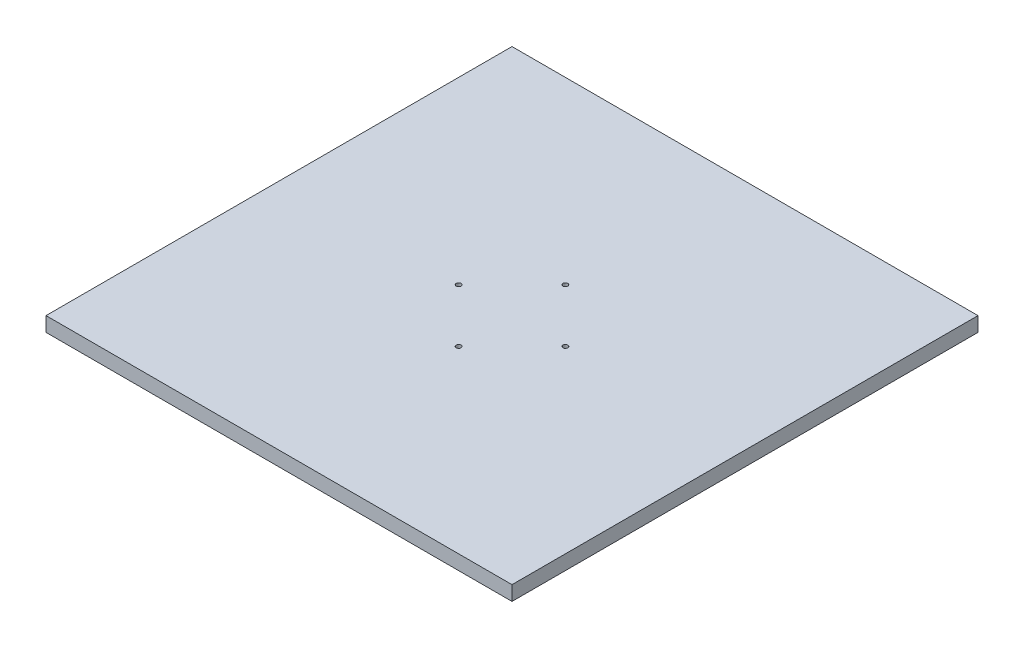
ISO-10303-21;
HEADER;
FILE_DESCRIPTION(('STEP AP214'),'2;1');
FILE_NAME('part.step','',(''),(''),'','','');
FILE_SCHEMA(('AUTOMOTIVE_DESIGN { 1 0 10303 214 1 1 1 1 }'));
ENDSEC;
DATA;
#1=APPLICATION_CONTEXT('core data for automotive mechanical design processes');
#2=APPLICATION_PROTOCOL_DEFINITION('international standard','automotive_design',2000,#1);
#3=PRODUCT_CONTEXT('',#1,'mechanical');
#4=PRODUCT('Part','Part','',(#3));
#5=PRODUCT_RELATED_PRODUCT_CATEGORY('part','',(#4));
#6=PRODUCT_DEFINITION_FORMATION('','',#4);
#7=PRODUCT_DEFINITION_CONTEXT('part definition',#1,'design');
#8=PRODUCT_DEFINITION('design','',#6,#7);
#9=PRODUCT_DEFINITION_SHAPE('','',#8);
#10=(LENGTH_UNIT() NAMED_UNIT(*) SI_UNIT(.MILLI.,.METRE.));
#11=(NAMED_UNIT(*) PLANE_ANGLE_UNIT() SI_UNIT($,.RADIAN.));
#12=(NAMED_UNIT(*) SI_UNIT($,.STERADIAN.) SOLID_ANGLE_UNIT());
#13=UNCERTAINTY_MEASURE_WITH_UNIT(LENGTH_MEASURE(1.E-05),#10,'distance_accuracy_value','');
#14=(GEOMETRIC_REPRESENTATION_CONTEXT(3) GLOBAL_UNCERTAINTY_ASSIGNED_CONTEXT((#13)) GLOBAL_UNIT_ASSIGNED_CONTEXT((#10,
#11,#12)) REPRESENTATION_CONTEXT('',''));
#15=CARTESIAN_POINT('',(0.,0.,0.));
#16=DIRECTION('',(0.,0.,1.));
#17=DIRECTION('',(1.,0.,0.));
#18=AXIS2_PLACEMENT_3D('',#15,#16,#17);
#19=CARTESIAN_POINT('',(0.,19.05,0.));
#20=DIRECTION('',(1.,0.,0.));
#21=DIRECTION('',(0.,0.,-1.));
#22=AXIS2_PLACEMENT_3D('',#19,#20,#21);
#23=PLANE('',#22);
#24=DIRECTION('',(0.,0.,1.));
#25=VECTOR('',#24,1.);
#26=CARTESIAN_POINT('',(0.,0.,0.));
#27=LINE('',#26,#25);
#28=CARTESIAN_POINT('',(0.,0.,-609.6));
#29=VERTEX_POINT('',#28);
#30=CARTESIAN_POINT('',(0.,0.,0.));
#31=VERTEX_POINT('',#30);
#32=EDGE_CURVE('E101',#29,#31,#27,.T.);
#33=ORIENTED_EDGE('',*,*,#32,.T.);
#34=DIRECTION('',(0.,-1.,0.));
#35=VECTOR('',#34,1.);
#36=CARTESIAN_POINT('',(0.,19.05,0.));
#37=LINE('',#36,#35);
#38=CARTESIAN_POINT('',(0.,19.05,0.));
#39=VERTEX_POINT('',#38);
#40=EDGE_CURVE('E11',#39,#31,#37,.T.);
#41=ORIENTED_EDGE('',*,*,#40,.F.);
#42=DIRECTION('',(0.,0.,1.));
#43=VECTOR('',#42,1.);
#44=CARTESIAN_POINT('',(0.,19.05,0.));
#45=LINE('',#44,#43);
#46=CARTESIAN_POINT('',(0.,19.05,-609.6));
#47=VERTEX_POINT('',#46);
#48=EDGE_CURVE('E89',#47,#39,#45,.T.);
#49=ORIENTED_EDGE('',*,*,#48,.F.);
#50=DIRECTION('',(0.,-1.,0.));
#51=VECTOR('',#50,1.);
#52=CARTESIAN_POINT('',(0.,19.05,-609.6));
#53=LINE('',#52,#51);
#54=EDGE_CURVE('E97',#47,#29,#53,.T.);
#55=ORIENTED_EDGE('',*,*,#54,.T.);
#56=EDGE_LOOP('',(#33,#41,#49,#55));
#57=FACE_BOUND('',#56,.T.);
#58=ADVANCED_FACE('F38',(#57),#23,.F.);
#59=CARTESIAN_POINT('',(0.,19.05,0.));
#60=DIRECTION('',(0.,0.,-1.));
#61=DIRECTION('',(-1.,0.,0.));
#62=AXIS2_PLACEMENT_3D('',#59,#60,#61);
#63=PLANE('',#62);
#64=DIRECTION('',(1.,0.,0.));
#65=VECTOR('',#64,1.);
#66=CARTESIAN_POINT('',(0.,0.,0.));
#67=LINE('',#66,#65);
#68=CARTESIAN_POINT('',(609.6,0.,0.));
#69=VERTEX_POINT('',#68);
#70=EDGE_CURVE('E93',#31,#69,#67,.T.);
#71=ORIENTED_EDGE('',*,*,#70,.T.);
#72=DIRECTION('',(0.,-1.,0.));
#73=VECTOR('',#72,1.);
#74=CARTESIAN_POINT('',(609.6,19.05,0.));
#75=LINE('',#74,#73);
#76=CARTESIAN_POINT('',(609.6,19.05,0.));
#77=VERTEX_POINT('',#76);
#78=EDGE_CURVE('E46',#77,#69,#75,.T.);
#79=ORIENTED_EDGE('',*,*,#78,.F.);
#80=DIRECTION('',(1.,0.,0.));
#81=VECTOR('',#80,1.);
#82=CARTESIAN_POINT('',(0.,19.05,0.));
#83=LINE('',#82,#81);
#84=EDGE_CURVE('E84',#39,#77,#83,.T.);
#85=ORIENTED_EDGE('',*,*,#84,.F.);
#86=ORIENTED_EDGE('',*,*,#40,.T.);
#87=EDGE_LOOP('',(#71,#79,#85,#86));
#88=FACE_BOUND('',#87,.T.);
#89=ADVANCED_FACE('F92',(#88),#63,.F.);
#90=CARTESIAN_POINT('',(609.6,19.05,0.));
#91=DIRECTION('',(-1.,0.,0.));
#92=DIRECTION('',(0.,0.,1.));
#93=AXIS2_PLACEMENT_3D('',#90,#91,#92);
#94=PLANE('',#93);
#95=DIRECTION('',(0.,0.,-1.));
#96=VECTOR('',#95,1.);
#97=CARTESIAN_POINT('',(609.6,0.,0.));
#98=LINE('',#97,#96);
#99=CARTESIAN_POINT('',(609.6,0.,-609.6));
#100=VERTEX_POINT('',#99);
#101=EDGE_CURVE('E71',#69,#100,#98,.T.);
#102=ORIENTED_EDGE('',*,*,#101,.T.);
#103=DIRECTION('',(0.,-1.,0.));
#104=VECTOR('',#103,1.);
#105=CARTESIAN_POINT('',(609.6,19.05,-609.6));
#106=LINE('',#105,#104);
#107=CARTESIAN_POINT('',(609.6,19.05,-609.6));
#108=VERTEX_POINT('',#107);
#109=EDGE_CURVE('E94',#108,#100,#106,.T.);
#110=ORIENTED_EDGE('',*,*,#109,.F.);
#111=DIRECTION('',(0.,0.,-1.));
#112=VECTOR('',#111,1.);
#113=CARTESIAN_POINT('',(609.6,19.05,0.));
#114=LINE('',#113,#112);
#115=EDGE_CURVE('E87',#77,#108,#114,.T.);
#116=ORIENTED_EDGE('',*,*,#115,.F.);
#117=ORIENTED_EDGE('',*,*,#78,.T.);
#118=EDGE_LOOP('',(#102,#110,#116,#117));
#119=FACE_BOUND('',#118,.T.);
#120=ADVANCED_FACE('F95',(#119),#94,.F.);
#121=CARTESIAN_POINT('',(0.,19.05,-609.6));
#122=DIRECTION('',(0.,0.,1.));
#123=DIRECTION('',(1.,0.,0.));
#124=AXIS2_PLACEMENT_3D('',#121,#122,#123);
#125=PLANE('',#124);
#126=DIRECTION('',(-1.,0.,0.));
#127=VECTOR('',#126,1.);
#128=CARTESIAN_POINT('',(0.,0.,-609.6));
#129=LINE('',#128,#127);
#130=EDGE_CURVE('E77',#100,#29,#129,.T.);
#131=ORIENTED_EDGE('',*,*,#130,.T.);
#132=ORIENTED_EDGE('',*,*,#54,.F.);
#133=DIRECTION('',(-1.,0.,0.));
#134=VECTOR('',#133,1.);
#135=CARTESIAN_POINT('',(0.,19.05,-609.6));
#136=LINE('',#135,#134);
#137=EDGE_CURVE('E54',#108,#47,#136,.T.);
#138=ORIENTED_EDGE('',*,*,#137,.F.);
#139=ORIENTED_EDGE('',*,*,#109,.T.);
#140=EDGE_LOOP('',(#131,#132,#138,#139));
#141=FACE_BOUND('',#140,.T.);
#142=ADVANCED_FACE('F109',(#141),#125,.F.);
#143=CARTESIAN_POINT('',(0.,19.05,0.));
#144=DIRECTION('',(0.,-1.,0.));
#145=DIRECTION('',(0.,0.,-1.));
#146=AXIS2_PLACEMENT_3D('',#143,#144,#145);
#147=PLANE('',#146);
#148=CARTESIAN_POINT('',(304.8,19.05,-374.65));
#149=DIRECTION('',(0.,1.,0.));
#150=DIRECTION('',(0.,0.,1.));
#151=AXIS2_PLACEMENT_3D('',#148,#149,#150);
#152=CIRCLE('',#151,3.17499999999997);
#153=CARTESIAN_POINT('',(304.8,19.05,-371.475));
#154=VERTEX_POINT('',#153);
#155=EDGE_CURVE('E104',#154,#154,#152,.T.);
#156=ORIENTED_EDGE('',*,*,#155,.F.);
#157=EDGE_LOOP('',(#156));
#158=FACE_BOUND('',#157,.T.);
#159=CARTESIAN_POINT('',(234.95,19.05,-304.8));
#160=DIRECTION('',(0.,1.,0.));
#161=DIRECTION('',(0.,0.,1.));
#162=AXIS2_PLACEMENT_3D('',#159,#160,#161);
#163=CIRCLE('',#162,3.175);
#164=CARTESIAN_POINT('',(234.95,19.05,-301.625));
#165=VERTEX_POINT('',#164);
#166=EDGE_CURVE('E122',#165,#165,#163,.T.);
#167=ORIENTED_EDGE('',*,*,#166,.F.);
#168=EDGE_LOOP('',(#167));
#169=FACE_BOUND('',#168,.T.);
#170=CARTESIAN_POINT('',(374.65,19.05,-304.8));
#171=DIRECTION('',(0.,1.,0.));
#172=DIRECTION('',(0.,0.,1.));
#173=AXIS2_PLACEMENT_3D('',#170,#171,#172);
#174=CIRCLE('',#173,3.17499999999997);
#175=CARTESIAN_POINT('',(374.65,19.05,-301.625));
#176=VERTEX_POINT('',#175);
#177=EDGE_CURVE('E118',#176,#176,#174,.T.);
#178=ORIENTED_EDGE('',*,*,#177,.F.);
#179=EDGE_LOOP('',(#178));
#180=FACE_BOUND('',#179,.T.);
#181=CARTESIAN_POINT('',(304.8,19.05,-234.95));
#182=DIRECTION('',(0.,1.,0.));
#183=DIRECTION('',(0.,0.,1.));
#184=AXIS2_PLACEMENT_3D('',#181,#182,#183);
#185=CIRCLE('',#184,3.17499999999997);
#186=CARTESIAN_POINT('',(304.8,19.05,-231.775));
#187=VERTEX_POINT('',#186);
#188=EDGE_CURVE('E115',#187,#187,#185,.T.);
#189=ORIENTED_EDGE('',*,*,#188,.F.);
#190=EDGE_LOOP('',(#189));
#191=FACE_BOUND('',#190,.T.);
#192=ORIENTED_EDGE('',*,*,#48,.T.);
#193=ORIENTED_EDGE('',*,*,#84,.T.);
#194=ORIENTED_EDGE('',*,*,#115,.T.);
#195=ORIENTED_EDGE('',*,*,#137,.T.);
#196=EDGE_LOOP('',(#192,#193,#194,#195));
#197=FACE_BOUND('',#196,.T.);
#198=ADVANCED_FACE('F85',(#158,#169,#180,#191,#197),#147,.F.);
#199=CARTESIAN_POINT('',(0.,0.,0.));
#200=DIRECTION('',(0.,-1.,0.));
#201=DIRECTION('',(0.,0.,-1.));
#202=AXIS2_PLACEMENT_3D('',#199,#200,#201);
#203=PLANE('',#202);
#204=CARTESIAN_POINT('',(234.95,0.,-304.8));
#205=DIRECTION('',(0.,-1.,0.));
#206=DIRECTION('',(0.,0.,-1.));
#207=AXIS2_PLACEMENT_3D('',#204,#205,#206);
#208=CIRCLE('',#207,9.52500000000001);
#209=CARTESIAN_POINT('',(234.95,0.,-314.325));
#210=VERTEX_POINT('',#209);
#211=EDGE_CURVE('E165',#210,#210,#208,.T.);
#212=ORIENTED_EDGE('',*,*,#211,.F.);
#213=EDGE_LOOP('',(#212));
#214=FACE_BOUND('',#213,.T.);
#215=CARTESIAN_POINT('',(304.8,0.,-234.95));
#216=DIRECTION('',(0.,-1.,0.));
#217=DIRECTION('',(0.,0.,-1.));
#218=AXIS2_PLACEMENT_3D('',#215,#216,#217);
#219=CIRCLE('',#218,9.52500000000001);
#220=CARTESIAN_POINT('',(304.8,0.,-244.475));
#221=VERTEX_POINT('',#220);
#222=EDGE_CURVE('E156',#221,#221,#219,.T.);
#223=ORIENTED_EDGE('',*,*,#222,.F.);
#224=EDGE_LOOP('',(#223));
#225=FACE_BOUND('',#224,.T.);
#226=CARTESIAN_POINT('',(374.65,0.,-304.8));
#227=DIRECTION('',(0.,-1.,0.));
#228=DIRECTION('',(0.,0.,-1.));
#229=AXIS2_PLACEMENT_3D('',#226,#227,#228);
#230=CIRCLE('',#229,9.52500000000001);
#231=CARTESIAN_POINT('',(374.65,0.,-314.325));
#232=VERTEX_POINT('',#231);
#233=EDGE_CURVE('E147',#232,#232,#230,.T.);
#234=ORIENTED_EDGE('',*,*,#233,.F.);
#235=EDGE_LOOP('',(#234));
#236=FACE_BOUND('',#235,.T.);
#237=CARTESIAN_POINT('',(304.8,0.,-374.65));
#238=DIRECTION('',(0.,-1.,0.));
#239=DIRECTION('',(0.,0.,-1.));
#240=AXIS2_PLACEMENT_3D('',#237,#238,#239);
#241=CIRCLE('',#240,9.52500000000001);
#242=CARTESIAN_POINT('',(304.8,0.,-384.175));
#243=VERTEX_POINT('',#242);
#244=EDGE_CURVE('E138',#243,#243,#241,.T.);
#245=ORIENTED_EDGE('',*,*,#244,.F.);
#246=EDGE_LOOP('',(#245));
#247=FACE_BOUND('',#246,.T.);
#248=CARTESIAN_POINT('',(304.8,0.,-304.8));
#249=DIRECTION('',(0.,1.,0.));
#250=DIRECTION('',(0.,0.,1.));
#251=AXIS2_PLACEMENT_3D('',#248,#249,#250);
#252=CIRCLE('',#251,8.76583361188347);
#253=CARTESIAN_POINT('',(304.8,0.,-296.034166388117));
#254=VERTEX_POINT('',#253);
#255=EDGE_CURVE('E127',#254,#254,#252,.T.);
#256=ORIENTED_EDGE('',*,*,#255,.T.);
#257=EDGE_LOOP('',(#256));
#258=FACE_BOUND('',#257,.T.);
#259=ORIENTED_EDGE('',*,*,#32,.F.);
#260=ORIENTED_EDGE('',*,*,#130,.F.);
#261=ORIENTED_EDGE('',*,*,#101,.F.);
#262=ORIENTED_EDGE('',*,*,#70,.F.);
#263=EDGE_LOOP('',(#259,#260,#261,#262));
#264=FACE_BOUND('',#263,.T.);
#265=ADVANCED_FACE('F112',(#214,#225,#236,#247,#258,#264),#203,.T.);
#266=CARTESIAN_POINT('',(304.8,0.,-234.95));
#267=DIRECTION('',(0.,1.,0.));
#268=DIRECTION('',(0.,0.,1.));
#269=AXIS2_PLACEMENT_3D('',#266,#267,#268);
#270=CYLINDRICAL_SURFACE('',#269,3.17499999999997);
#271=CARTESIAN_POINT('',(304.8,6.35,-234.95));
#272=DIRECTION('',(0.,-1.,0.));
#273=DIRECTION('',(0.,0.,-1.));
#274=AXIS2_PLACEMENT_3D('',#271,#272,#273);
#275=CIRCLE('',#274,3.17500000000004);
#276=CARTESIAN_POINT('',(304.8,6.35,-238.125));
#277=VERTEX_POINT('',#276);
#278=EDGE_CURVE('E150',#277,#277,#275,.T.);
#279=ORIENTED_EDGE('',*,*,#278,.T.);
#280=EDGE_LOOP('',(#279));
#281=FACE_BOUND('',#280,.T.);
#282=ORIENTED_EDGE('',*,*,#188,.T.);
#283=EDGE_LOOP('',(#282));
#284=FACE_BOUND('',#283,.T.);
#285=ADVANCED_FACE('F173',(#281,#284),#270,.F.);
#286=CARTESIAN_POINT('',(374.65,0.,-304.8));
#287=DIRECTION('',(0.,1.,0.));
#288=DIRECTION('',(0.,0.,1.));
#289=AXIS2_PLACEMENT_3D('',#286,#287,#288);
#290=CYLINDRICAL_SURFACE('',#289,3.17499999999997);
#291=CARTESIAN_POINT('',(374.65,6.35,-304.8));
#292=DIRECTION('',(0.,-1.,0.));
#293=DIRECTION('',(0.,0.,-1.));
#294=AXIS2_PLACEMENT_3D('',#291,#292,#293);
#295=CIRCLE('',#294,3.17500000000004);
#296=CARTESIAN_POINT('',(374.65,6.35,-307.975));
#297=VERTEX_POINT('',#296);
#298=EDGE_CURVE('E141',#297,#297,#295,.T.);
#299=ORIENTED_EDGE('',*,*,#298,.T.);
#300=EDGE_LOOP('',(#299));
#301=FACE_BOUND('',#300,.T.);
#302=ORIENTED_EDGE('',*,*,#177,.T.);
#303=EDGE_LOOP('',(#302));
#304=FACE_BOUND('',#303,.T.);
#305=ADVANCED_FACE('F215',(#301,#304),#290,.F.);
#306=CARTESIAN_POINT('',(234.95,0.,-304.8));
#307=DIRECTION('',(0.,1.,0.));
#308=DIRECTION('',(0.,0.,1.));
#309=AXIS2_PLACEMENT_3D('',#306,#307,#308);
#310=CYLINDRICAL_SURFACE('',#309,3.175);
#311=CARTESIAN_POINT('',(234.95,6.35,-304.8));
#312=DIRECTION('',(0.,-1.,0.));
#313=DIRECTION('',(0.,0.,-1.));
#314=AXIS2_PLACEMENT_3D('',#311,#312,#313);
#315=CIRCLE('',#314,3.17500000000001);
#316=CARTESIAN_POINT('',(234.95,6.35,-307.975));
#317=VERTEX_POINT('',#316);
#318=EDGE_CURVE('E159',#317,#317,#315,.T.);
#319=ORIENTED_EDGE('',*,*,#318,.T.);
#320=EDGE_LOOP('',(#319));
#321=FACE_BOUND('',#320,.T.);
#322=ORIENTED_EDGE('',*,*,#166,.T.);
#323=EDGE_LOOP('',(#322));
#324=FACE_BOUND('',#323,.T.);
#325=ADVANCED_FACE('F196',(#321,#324),#310,.F.);
#326=CARTESIAN_POINT('',(304.8,0.,-374.65));
#327=DIRECTION('',(0.,1.,0.));
#328=DIRECTION('',(0.,0.,1.));
#329=AXIS2_PLACEMENT_3D('',#326,#327,#328);
#330=CYLINDRICAL_SURFACE('',#329,3.17499999999997);
#331=CARTESIAN_POINT('',(304.8,6.35,-374.65));
#332=DIRECTION('',(0.,-1.,0.));
#333=DIRECTION('',(0.,0.,-1.));
#334=AXIS2_PLACEMENT_3D('',#331,#332,#333);
#335=CIRCLE('',#334,3.17500000000004);
#336=CARTESIAN_POINT('',(304.8,6.35,-377.825));
#337=VERTEX_POINT('',#336);
#338=EDGE_CURVE('E130',#337,#337,#335,.T.);
#339=ORIENTED_EDGE('',*,*,#338,.T.);
#340=EDGE_LOOP('',(#339));
#341=FACE_BOUND('',#340,.T.);
#342=ORIENTED_EDGE('',*,*,#155,.T.);
#343=EDGE_LOOP('',(#342));
#344=FACE_BOUND('',#343,.T.);
#345=ADVANCED_FACE('F186',(#341,#344),#330,.F.);
#346=CARTESIAN_POINT('',(304.8,2.54,-304.8));
#347=DIRECTION('',(0.,-1.,0.));
#348=DIRECTION('',(0.,0.,-1.));
#349=AXIS2_PLACEMENT_3D('',#346,#347,#348);
#350=CYLINDRICAL_SURFACE('',#349,8.76583361188347);
#351=CARTESIAN_POINT('',(304.8,2.54,-304.8));
#352=DIRECTION('',(0.,1.,0.));
#353=DIRECTION('',(0.,0.,1.));
#354=AXIS2_PLACEMENT_3D('',#351,#352,#353);
#355=CIRCLE('',#354,8.76583361188347);
#356=CARTESIAN_POINT('',(304.8,2.54,-296.034166388117));
#357=VERTEX_POINT('',#356);
#358=EDGE_CURVE('E119',#357,#357,#355,.T.);
#359=ORIENTED_EDGE('',*,*,#358,.T.);
#360=EDGE_LOOP('',(#359));
#361=FACE_BOUND('',#360,.T.);
#362=ORIENTED_EDGE('',*,*,#255,.F.);
#363=EDGE_LOOP('',(#362));
#364=FACE_BOUND('',#363,.T.);
#365=ADVANCED_FACE('F183',(#361,#364),#350,.F.);
#366=CARTESIAN_POINT('',(304.8,2.54,-304.8));
#367=DIRECTION('',(0.,1.,0.));
#368=DIRECTION('',(0.,0.,1.));
#369=AXIS2_PLACEMENT_3D('',#366,#367,#368);
#370=PLANE('',#369);
#371=ORIENTED_EDGE('',*,*,#358,.F.);
#372=EDGE_LOOP('',(#371));
#373=FACE_BOUND('',#372,.T.);
#374=ADVANCED_FACE('F185',(#373),#370,.F.);
#375=CARTESIAN_POINT('',(307.975,6.35,-374.65));
#376=DIRECTION('',(0.,1.,0.));
#377=DIRECTION('',(0.,0.,1.));
#378=AXIS2_PLACEMENT_3D('',#375,#376,#377);
#379=PLANE('',#378);
#380=ORIENTED_EDGE('',*,*,#338,.F.);
#381=EDGE_LOOP('',(#380));
#382=FACE_BOUND('',#381,.T.);
#383=CARTESIAN_POINT('',(304.8,6.35,-374.65));
#384=DIRECTION('',(0.,-1.,0.));
#385=DIRECTION('',(0.,0.,-1.));
#386=AXIS2_PLACEMENT_3D('',#383,#384,#385);
#387=CIRCLE('',#386,9.52500000000001);
#388=CARTESIAN_POINT('',(304.8,6.35,-384.175));
#389=VERTEX_POINT('',#388);
#390=EDGE_CURVE('E135',#389,#389,#387,.T.);
#391=ORIENTED_EDGE('',*,*,#390,.T.);
#392=EDGE_LOOP('',(#391));
#393=FACE_BOUND('',#392,.T.);
#394=ADVANCED_FACE('F193',(#382,#393),#379,.F.);
#395=CARTESIAN_POINT('',(304.8,0.,-374.65));
#396=DIRECTION('',(0.,-1.,0.));
#397=DIRECTION('',(0.,0.,-1.));
#398=AXIS2_PLACEMENT_3D('',#395,#396,#397);
#399=CYLINDRICAL_SURFACE('',#398,9.52500000000001);
#400=ORIENTED_EDGE('',*,*,#390,.F.);
#401=EDGE_LOOP('',(#400));
#402=FACE_BOUND('',#401,.T.);
#403=ORIENTED_EDGE('',*,*,#244,.T.);
#404=EDGE_LOOP('',(#403));
#405=FACE_BOUND('',#404,.T.);
#406=ADVANCED_FACE('F261',(#402,#405),#399,.F.);
#407=CARTESIAN_POINT('',(377.825,6.35,-304.8));
#408=DIRECTION('',(0.,1.,0.));
#409=DIRECTION('',(0.,0.,1.));
#410=AXIS2_PLACEMENT_3D('',#407,#408,#409);
#411=PLANE('',#410);
#412=ORIENTED_EDGE('',*,*,#298,.F.);
#413=EDGE_LOOP('',(#412));
#414=FACE_BOUND('',#413,.T.);
#415=CARTESIAN_POINT('',(374.65,6.35,-304.8));
#416=DIRECTION('',(0.,-1.,0.));
#417=DIRECTION('',(0.,0.,-1.));
#418=AXIS2_PLACEMENT_3D('',#415,#416,#417);
#419=CIRCLE('',#418,9.52500000000001);
#420=CARTESIAN_POINT('',(374.65,6.35,-314.325));
#421=VERTEX_POINT('',#420);
#422=EDGE_CURVE('E144',#421,#421,#419,.T.);
#423=ORIENTED_EDGE('',*,*,#422,.T.);
#424=EDGE_LOOP('',(#423));
#425=FACE_BOUND('',#424,.T.);
#426=ADVANCED_FACE('F257',(#414,#425),#411,.F.);
#427=CARTESIAN_POINT('',(374.65,0.,-304.8));
#428=DIRECTION('',(0.,-1.,0.));
#429=DIRECTION('',(0.,0.,-1.));
#430=AXIS2_PLACEMENT_3D('',#427,#428,#429);
#431=CYLINDRICAL_SURFACE('',#430,9.52500000000001);
#432=ORIENTED_EDGE('',*,*,#422,.F.);
#433=EDGE_LOOP('',(#432));
#434=FACE_BOUND('',#433,.T.);
#435=ORIENTED_EDGE('',*,*,#233,.T.);
#436=EDGE_LOOP('',(#435));
#437=FACE_BOUND('',#436,.T.);
#438=ADVANCED_FACE('F253',(#434,#437),#431,.F.);
#439=CARTESIAN_POINT('',(307.975,6.35,-234.95));
#440=DIRECTION('',(0.,1.,0.));
#441=DIRECTION('',(0.,0.,1.));
#442=AXIS2_PLACEMENT_3D('',#439,#440,#441);
#443=PLANE('',#442);
#444=ORIENTED_EDGE('',*,*,#278,.F.);
#445=EDGE_LOOP('',(#444));
#446=FACE_BOUND('',#445,.T.);
#447=CARTESIAN_POINT('',(304.8,6.35,-234.95));
#448=DIRECTION('',(0.,-1.,0.));
#449=DIRECTION('',(0.,0.,-1.));
#450=AXIS2_PLACEMENT_3D('',#447,#448,#449);
#451=CIRCLE('',#450,9.52500000000001);
#452=CARTESIAN_POINT('',(304.8,6.35,-244.475));
#453=VERTEX_POINT('',#452);
#454=EDGE_CURVE('E153',#453,#453,#451,.T.);
#455=ORIENTED_EDGE('',*,*,#454,.T.);
#456=EDGE_LOOP('',(#455));
#457=FACE_BOUND('',#456,.T.);
#458=ADVANCED_FACE('F249',(#446,#457),#443,.F.);
#459=CARTESIAN_POINT('',(304.8,0.,-234.95));
#460=DIRECTION('',(0.,-1.,0.));
#461=DIRECTION('',(0.,0.,-1.));
#462=AXIS2_PLACEMENT_3D('',#459,#460,#461);
#463=CYLINDRICAL_SURFACE('',#462,9.52500000000001);
#464=ORIENTED_EDGE('',*,*,#454,.F.);
#465=EDGE_LOOP('',(#464));
#466=FACE_BOUND('',#465,.T.);
#467=ORIENTED_EDGE('',*,*,#222,.T.);
#468=EDGE_LOOP('',(#467));
#469=FACE_BOUND('',#468,.T.);
#470=ADVANCED_FACE('F238',(#466,#469),#463,.F.);
#471=CARTESIAN_POINT('',(238.125,6.35,-304.8));
#472=DIRECTION('',(0.,1.,0.));
#473=DIRECTION('',(0.,0.,1.));
#474=AXIS2_PLACEMENT_3D('',#471,#472,#473);
#475=PLANE('',#474);
#476=ORIENTED_EDGE('',*,*,#318,.F.);
#477=EDGE_LOOP('',(#476));
#478=FACE_BOUND('',#477,.T.);
#479=CARTESIAN_POINT('',(234.95,6.35,-304.8));
#480=DIRECTION('',(0.,-1.,0.));
#481=DIRECTION('',(0.,0.,-1.));
#482=AXIS2_PLACEMENT_3D('',#479,#480,#481);
#483=CIRCLE('',#482,9.52500000000001);
#484=CARTESIAN_POINT('',(234.95,6.35,-314.325));
#485=VERTEX_POINT('',#484);
#486=EDGE_CURVE('E162',#485,#485,#483,.T.);
#487=ORIENTED_EDGE('',*,*,#486,.T.);
#488=EDGE_LOOP('',(#487));
#489=FACE_BOUND('',#488,.T.);
#490=ADVANCED_FACE('F235',(#478,#489),#475,.F.);
#491=CARTESIAN_POINT('',(234.95,0.,-304.8));
#492=DIRECTION('',(0.,-1.,0.));
#493=DIRECTION('',(0.,0.,-1.));
#494=AXIS2_PLACEMENT_3D('',#491,#492,#493);
#495=CYLINDRICAL_SURFACE('',#494,9.52500000000001);
#496=ORIENTED_EDGE('',*,*,#486,.F.);
#497=EDGE_LOOP('',(#496));
#498=FACE_BOUND('',#497,.T.);
#499=ORIENTED_EDGE('',*,*,#211,.T.);
#500=EDGE_LOOP('',(#499));
#501=FACE_BOUND('',#500,.T.);
#502=ADVANCED_FACE('F169',(#498,#501),#495,.F.);
#503=CLOSED_SHELL('',(#58,#89,#120,#142,#198,#265,#285,#305,#325,#345,#365,#374,#394,#406,#426,
#438,#458,#470,#490,#502));
#504=MANIFOLD_SOLID_BREP('B2',#503);
#505=ADVANCED_BREP_SHAPE_REPRESENTATION('',(#18,#504),#14);
#506=SHAPE_DEFINITION_REPRESENTATION(#9,#505);
ENDSEC;
END-ISO-10303-21;
